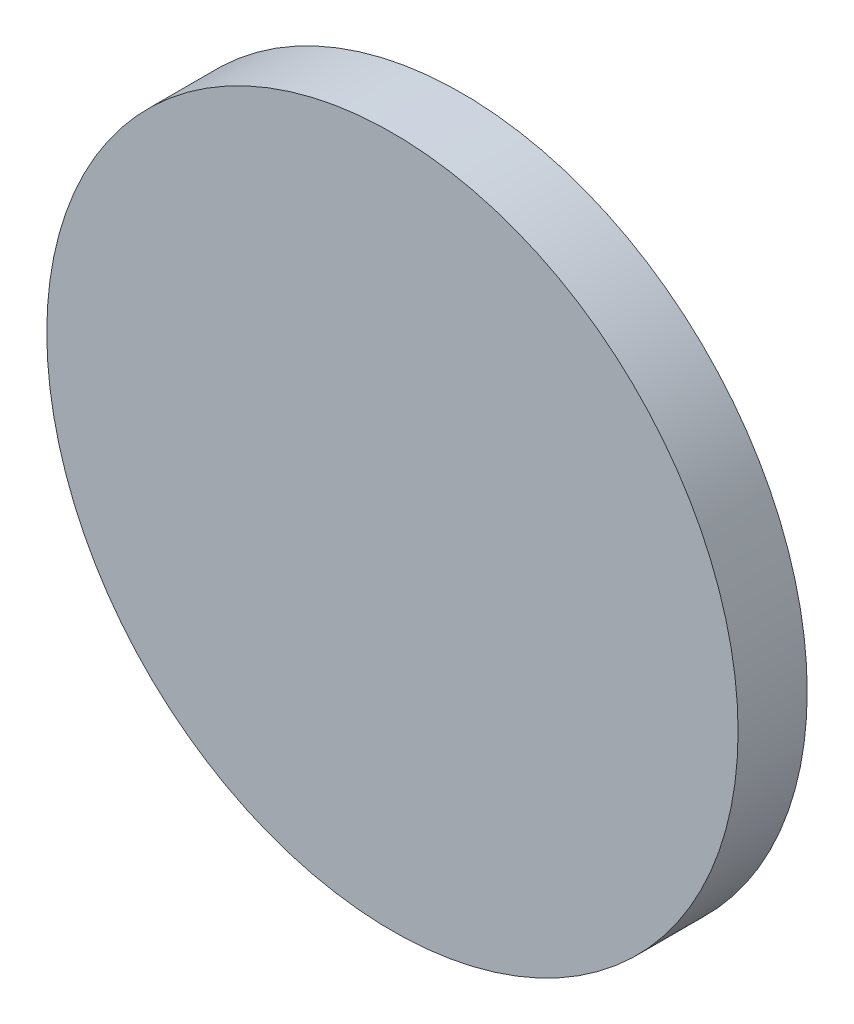
ISO-10303-21;
HEADER;
FILE_DESCRIPTION(('STEP AP214'),'2;1');
FILE_NAME('part.step','',(''),(''),'','','');
FILE_SCHEMA(('AUTOMOTIVE_DESIGN { 1 0 10303 214 1 1 1 1 }'));
ENDSEC;
DATA;
#1=APPLICATION_CONTEXT('core data for automotive mechanical design processes');
#2=APPLICATION_PROTOCOL_DEFINITION('international standard','automotive_design',2000,#1);
#3=PRODUCT_CONTEXT('',#1,'mechanical');
#4=PRODUCT('Part','Part','',(#3));
#5=PRODUCT_RELATED_PRODUCT_CATEGORY('part','',(#4));
#6=PRODUCT_DEFINITION_FORMATION('','',#4);
#7=PRODUCT_DEFINITION_CONTEXT('part definition',#1,'design');
#8=PRODUCT_DEFINITION('design','',#6,#7);
#9=PRODUCT_DEFINITION_SHAPE('','',#8);
#10=(LENGTH_UNIT() NAMED_UNIT(*) SI_UNIT(.MILLI.,.METRE.));
#11=(NAMED_UNIT(*) PLANE_ANGLE_UNIT() SI_UNIT($,.RADIAN.));
#12=(NAMED_UNIT(*) SI_UNIT($,.STERADIAN.) SOLID_ANGLE_UNIT());
#13=UNCERTAINTY_MEASURE_WITH_UNIT(LENGTH_MEASURE(1.E-05),#10,'distance_accuracy_value','');
#14=(GEOMETRIC_REPRESENTATION_CONTEXT(3) GLOBAL_UNCERTAINTY_ASSIGNED_CONTEXT((#13)) GLOBAL_UNIT_ASSIGNED_CONTEXT((#10,
#11,#12)) REPRESENTATION_CONTEXT('',''));
#15=CARTESIAN_POINT('',(0.,0.,0.));
#16=DIRECTION('',(0.,0.,1.));
#17=DIRECTION('',(1.,0.,0.));
#18=AXIS2_PLACEMENT_3D('',#15,#16,#17);
#19=CARTESIAN_POINT('',(0.,0.,0.1999996));
#20=DIRECTION('',(0.,0.,1.));
#21=DIRECTION('',(1.,0.,0.));
#22=AXIS2_PLACEMENT_3D('',#19,#20,#21);
#23=PLANE('',#22);
#24=CARTESIAN_POINT('',(0.,0.,0.1999996));
#25=DIRECTION('',(0.,0.,1.));
#26=DIRECTION('',(1.,0.,0.));
#27=AXIS2_PLACEMENT_3D('',#24,#25,#26);
#28=CIRCLE('',#27,1.00000054);
#29=CARTESIAN_POINT('',(-1.00000054,0.,0.1999996));
#30=VERTEX_POINT('',#29);
#31=EDGE_CURVE('E11',#30,#30,#28,.T.);
#32=ORIENTED_EDGE('',*,*,#31,.T.);
#33=EDGE_LOOP('',(#32));
#34=FACE_BOUND('',#33,.T.);
#35=ADVANCED_FACE('F16',(#34),#23,.T.);
#36=CARTESIAN_POINT('',(0.,0.,0.));
#37=DIRECTION('',(0.,0.,1.));
#38=DIRECTION('',(1.,0.,0.));
#39=AXIS2_PLACEMENT_3D('',#36,#37,#38);
#40=PLANE('',#39);
#41=CARTESIAN_POINT('',(0.,0.,0.));
#42=DIRECTION('',(0.,0.,1.));
#43=DIRECTION('',(1.,0.,0.));
#44=AXIS2_PLACEMENT_3D('',#41,#42,#43);
#45=CIRCLE('',#44,1.00000054);
#46=CARTESIAN_POINT('',(-1.00000054,0.,0.));
#47=VERTEX_POINT('',#46);
#48=EDGE_CURVE('E42',#47,#47,#45,.T.);
#49=ORIENTED_EDGE('',*,*,#48,.F.);
#50=EDGE_LOOP('',(#49));
#51=FACE_BOUND('',#50,.T.);
#52=ADVANCED_FACE('F18',(#51),#40,.F.);
#53=CARTESIAN_POINT('',(0.,0.,0.));
#54=DIRECTION('',(0.,0.,-1.));
#55=DIRECTION('',(1.,0.,0.));
#56=AXIS2_PLACEMENT_3D('',#53,#54,#55);
#57=CYLINDRICAL_SURFACE('',#56,1.00000054);
#58=ORIENTED_EDGE('',*,*,#48,.T.);
#59=DIRECTION('',(0.,0.,1.));
#60=VECTOR('',#59,1.);
#61=CARTESIAN_POINT('',(-1.00000054,0.,0.));
#62=LINE('',#61,#60);
#63=EDGE_CURVE('E25',#47,#30,#62,.T.);
#64=ORIENTED_EDGE('',*,*,#63,.T.);
#65=ORIENTED_EDGE('',*,*,#31,.F.);
#66=ORIENTED_EDGE('',*,*,#63,.F.);
#67=EDGE_LOOP('',(#58,#64,#65,#66));
#68=FACE_BOUND('',#67,.T.);
#69=ADVANCED_FACE('F40',(#68),#57,.T.);
#70=CLOSED_SHELL('',(#35,#52,#69));
#71=MANIFOLD_SOLID_BREP('B1',#70);
#72=ADVANCED_BREP_SHAPE_REPRESENTATION('',(#18,#71),#14);
#73=SHAPE_DEFINITION_REPRESENTATION(#9,#72);
ENDSEC;
END-ISO-10303-21;
